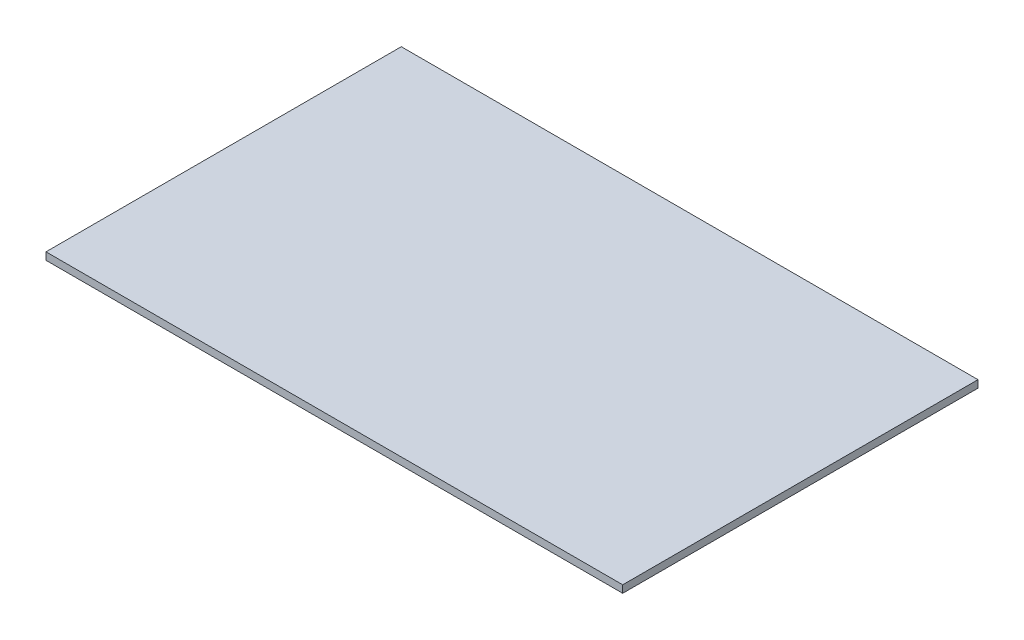
ISO-10303-21;
HEADER;
FILE_DESCRIPTION(('STEP AP214'),'2;1');
FILE_NAME('part.step','',(''),(''),'','','');
FILE_SCHEMA(('AUTOMOTIVE_DESIGN { 1 0 10303 214 1 1 1 1 }'));
ENDSEC;
DATA;
#1=APPLICATION_CONTEXT('core data for automotive mechanical design processes');
#2=APPLICATION_PROTOCOL_DEFINITION('international standard','automotive_design',2000,#1);
#3=PRODUCT_CONTEXT('',#1,'mechanical');
#4=PRODUCT('Part','Part','',(#3));
#5=PRODUCT_RELATED_PRODUCT_CATEGORY('part','',(#4));
#6=PRODUCT_DEFINITION_FORMATION('','',#4);
#7=PRODUCT_DEFINITION_CONTEXT('part definition',#1,'design');
#8=PRODUCT_DEFINITION('design','',#6,#7);
#9=PRODUCT_DEFINITION_SHAPE('','',#8);
#10=(LENGTH_UNIT() NAMED_UNIT(*) SI_UNIT(.MILLI.,.METRE.));
#11=(NAMED_UNIT(*) PLANE_ANGLE_UNIT() SI_UNIT($,.RADIAN.));
#12=(NAMED_UNIT(*) SI_UNIT($,.STERADIAN.) SOLID_ANGLE_UNIT());
#13=UNCERTAINTY_MEASURE_WITH_UNIT(LENGTH_MEASURE(1.E-05),#10,'distance_accuracy_value','');
#14=(GEOMETRIC_REPRESENTATION_CONTEXT(3) GLOBAL_UNCERTAINTY_ASSIGNED_CONTEXT((#13)) GLOBAL_UNIT_ASSIGNED_CONTEXT((#10,
#11,#12)) REPRESENTATION_CONTEXT('',''));
#15=CARTESIAN_POINT('',(0.,0.,0.));
#16=DIRECTION('',(0.,0.,1.));
#17=DIRECTION('',(1.,0.,0.));
#18=AXIS2_PLACEMENT_3D('',#15,#16,#17);
#19=CARTESIAN_POINT('',(117.094,3.,-72.136));
#20=DIRECTION('',(-1.,0.,0.));
#21=DIRECTION('',(0.,0.,1.));
#22=AXIS2_PLACEMENT_3D('',#19,#20,#21);
#23=PLANE('',#22);
#24=DIRECTION('',(0.,0.,-1.));
#25=VECTOR('',#24,1.);
#26=CARTESIAN_POINT('',(117.094,0.,-72.136));
#27=LINE('',#26,#25);
#28=CARTESIAN_POINT('',(117.094,0.,72.136));
#29=VERTEX_POINT('',#28);
#30=CARTESIAN_POINT('',(117.094,0.,-72.136));
#31=VERTEX_POINT('',#30);
#32=EDGE_CURVE('E95',#29,#31,#27,.T.);
#33=ORIENTED_EDGE('',*,*,#32,.T.);
#34=DIRECTION('',(0.,-1.,0.));
#35=VECTOR('',#34,1.);
#36=CARTESIAN_POINT('',(117.094,3.,-72.136));
#37=LINE('',#36,#35);
#38=CARTESIAN_POINT('',(117.094,3.,-72.136));
#39=VERTEX_POINT('',#38);
#40=EDGE_CURVE('E11',#39,#31,#37,.T.);
#41=ORIENTED_EDGE('',*,*,#40,.F.);
#42=DIRECTION('',(0.,0.,-1.));
#43=VECTOR('',#42,1.);
#44=CARTESIAN_POINT('',(117.094,3.,-72.136));
#45=LINE('',#44,#43);
#46=CARTESIAN_POINT('',(117.094,3.,72.136));
#47=VERTEX_POINT('',#46);
#48=EDGE_CURVE('E83',#47,#39,#45,.T.);
#49=ORIENTED_EDGE('',*,*,#48,.F.);
#50=DIRECTION('',(0.,-1.,0.));
#51=VECTOR('',#50,1.);
#52=CARTESIAN_POINT('',(117.094,3.,72.136));
#53=LINE('',#52,#51);
#54=EDGE_CURVE('E91',#47,#29,#53,.T.);
#55=ORIENTED_EDGE('',*,*,#54,.T.);
#56=EDGE_LOOP('',(#33,#41,#49,#55));
#57=FACE_BOUND('',#56,.T.);
#58=ADVANCED_FACE('F32',(#57),#23,.F.);
#59=CARTESIAN_POINT('',(-117.094,3.,-72.136));
#60=DIRECTION('',(0.,0.,1.));
#61=DIRECTION('',(1.,0.,0.));
#62=AXIS2_PLACEMENT_3D('',#59,#60,#61);
#63=PLANE('',#62);
#64=DIRECTION('',(-1.,0.,0.));
#65=VECTOR('',#64,1.);
#66=CARTESIAN_POINT('',(-117.094,0.,-72.136));
#67=LINE('',#66,#65);
#68=CARTESIAN_POINT('',(-117.094,0.,-72.136));
#69=VERTEX_POINT('',#68);
#70=EDGE_CURVE('E87',#31,#69,#67,.T.);
#71=ORIENTED_EDGE('',*,*,#70,.T.);
#72=DIRECTION('',(0.,-1.,0.));
#73=VECTOR('',#72,1.);
#74=CARTESIAN_POINT('',(-117.094,3.,-72.136));
#75=LINE('',#74,#73);
#76=CARTESIAN_POINT('',(-117.094,3.,-72.136));
#77=VERTEX_POINT('',#76);
#78=EDGE_CURVE('E40',#77,#69,#75,.T.);
#79=ORIENTED_EDGE('',*,*,#78,.F.);
#80=DIRECTION('',(-1.,0.,0.));
#81=VECTOR('',#80,1.);
#82=CARTESIAN_POINT('',(-117.094,3.,-72.136));
#83=LINE('',#82,#81);
#84=EDGE_CURVE('E78',#39,#77,#83,.T.);
#85=ORIENTED_EDGE('',*,*,#84,.F.);
#86=ORIENTED_EDGE('',*,*,#40,.T.);
#87=EDGE_LOOP('',(#71,#79,#85,#86));
#88=FACE_BOUND('',#87,.T.);
#89=ADVANCED_FACE('F86',(#88),#63,.F.);
#90=CARTESIAN_POINT('',(-117.094,3.,-72.136));
#91=DIRECTION('',(1.,0.,0.));
#92=DIRECTION('',(0.,0.,-1.));
#93=AXIS2_PLACEMENT_3D('',#90,#91,#92);
#94=PLANE('',#93);
#95=DIRECTION('',(0.,0.,1.));
#96=VECTOR('',#95,1.);
#97=CARTESIAN_POINT('',(-117.094,0.,-72.136));
#98=LINE('',#97,#96);
#99=CARTESIAN_POINT('',(-117.094,0.,72.136));
#100=VERTEX_POINT('',#99);
#101=EDGE_CURVE('E65',#69,#100,#98,.T.);
#102=ORIENTED_EDGE('',*,*,#101,.T.);
#103=DIRECTION('',(0.,-1.,0.));
#104=VECTOR('',#103,1.);
#105=CARTESIAN_POINT('',(-117.094,3.,72.136));
#106=LINE('',#105,#104);
#107=CARTESIAN_POINT('',(-117.094,3.,72.136));
#108=VERTEX_POINT('',#107);
#109=EDGE_CURVE('E88',#108,#100,#106,.T.);
#110=ORIENTED_EDGE('',*,*,#109,.F.);
#111=DIRECTION('',(0.,0.,1.));
#112=VECTOR('',#111,1.);
#113=CARTESIAN_POINT('',(-117.094,3.,-72.136));
#114=LINE('',#113,#112);
#115=EDGE_CURVE('E81',#77,#108,#114,.T.);
#116=ORIENTED_EDGE('',*,*,#115,.F.);
#117=ORIENTED_EDGE('',*,*,#78,.T.);
#118=EDGE_LOOP('',(#102,#110,#116,#117));
#119=FACE_BOUND('',#118,.T.);
#120=ADVANCED_FACE('F89',(#119),#94,.F.);
#121=CARTESIAN_POINT('',(-117.094,3.,72.136));
#122=DIRECTION('',(0.,0.,-1.));
#123=DIRECTION('',(-1.,0.,0.));
#124=AXIS2_PLACEMENT_3D('',#121,#122,#123);
#125=PLANE('',#124);
#126=DIRECTION('',(1.,0.,0.));
#127=VECTOR('',#126,1.);
#128=CARTESIAN_POINT('',(-117.094,0.,72.136));
#129=LINE('',#128,#127);
#130=EDGE_CURVE('E71',#100,#29,#129,.T.);
#131=ORIENTED_EDGE('',*,*,#130,.T.);
#132=ORIENTED_EDGE('',*,*,#54,.F.);
#133=DIRECTION('',(1.,0.,0.));
#134=VECTOR('',#133,1.);
#135=CARTESIAN_POINT('',(-117.094,3.,72.136));
#136=LINE('',#135,#134);
#137=EDGE_CURVE('E48',#108,#47,#136,.T.);
#138=ORIENTED_EDGE('',*,*,#137,.F.);
#139=ORIENTED_EDGE('',*,*,#109,.T.);
#140=EDGE_LOOP('',(#131,#132,#138,#139));
#141=FACE_BOUND('',#140,.T.);
#142=ADVANCED_FACE('F102',(#141),#125,.F.);
#143=CARTESIAN_POINT('',(0.,3.,0.));
#144=DIRECTION('',(0.,1.,0.));
#145=DIRECTION('',(0.,0.,1.));
#146=AXIS2_PLACEMENT_3D('',#143,#144,#145);
#147=PLANE('',#146);
#148=ORIENTED_EDGE('',*,*,#48,.T.);
#149=ORIENTED_EDGE('',*,*,#84,.T.);
#150=ORIENTED_EDGE('',*,*,#115,.T.);
#151=ORIENTED_EDGE('',*,*,#137,.T.);
#152=EDGE_LOOP('',(#148,#149,#150,#151));
#153=FACE_BOUND('',#152,.T.);
#154=ADVANCED_FACE('F79',(#153),#147,.T.);
#155=CARTESIAN_POINT('',(0.,0.,0.));
#156=DIRECTION('',(0.,1.,0.));
#157=DIRECTION('',(0.,0.,1.));
#158=AXIS2_PLACEMENT_3D('',#155,#156,#157);
#159=PLANE('',#158);
#160=ORIENTED_EDGE('',*,*,#32,.F.);
#161=ORIENTED_EDGE('',*,*,#130,.F.);
#162=ORIENTED_EDGE('',*,*,#101,.F.);
#163=ORIENTED_EDGE('',*,*,#70,.F.);
#164=EDGE_LOOP('',(#160,#161,#162,#163));
#165=FACE_BOUND('',#164,.T.);
#166=ADVANCED_FACE('F105',(#165),#159,.F.);
#167=CLOSED_SHELL('',(#58,#89,#120,#142,#154,#166));
#168=MANIFOLD_SOLID_BREP('B2',#167);
#169=ADVANCED_BREP_SHAPE_REPRESENTATION('',(#18,#168),#14);
#170=SHAPE_DEFINITION_REPRESENTATION(#9,#169);
ENDSEC;
END-ISO-10303-21;
